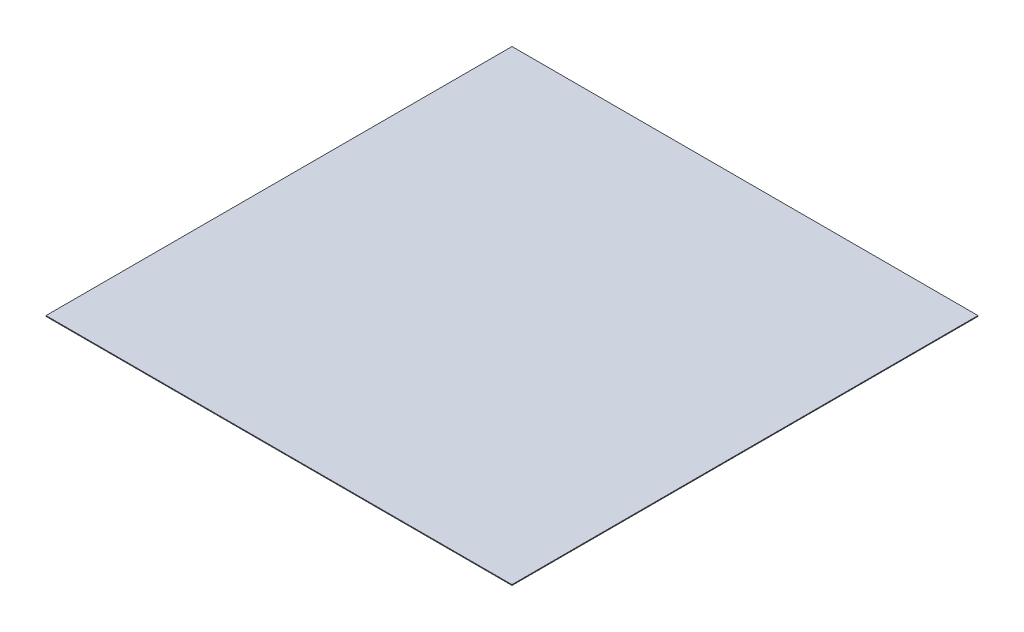
ISO-10303-21;
HEADER;
FILE_DESCRIPTION(('STEP AP214'),'2;1');
FILE_NAME('part.step','',(''),(''),'','','');
FILE_SCHEMA(('AUTOMOTIVE_DESIGN { 1 0 10303 214 1 1 1 1 }'));
ENDSEC;
DATA;
#1=APPLICATION_CONTEXT('core data for automotive mechanical design processes');
#2=APPLICATION_PROTOCOL_DEFINITION('international standard','automotive_design',2000,#1);
#3=PRODUCT_CONTEXT('',#1,'mechanical');
#4=PRODUCT('Part','Part','',(#3));
#5=PRODUCT_RELATED_PRODUCT_CATEGORY('part','',(#4));
#6=PRODUCT_DEFINITION_FORMATION('','',#4);
#7=PRODUCT_DEFINITION_CONTEXT('part definition',#1,'design');
#8=PRODUCT_DEFINITION('design','',#6,#7);
#9=PRODUCT_DEFINITION_SHAPE('','',#8);
#10=(LENGTH_UNIT() NAMED_UNIT(*) SI_UNIT(.MILLI.,.METRE.));
#11=(NAMED_UNIT(*) PLANE_ANGLE_UNIT() SI_UNIT($,.RADIAN.));
#12=(NAMED_UNIT(*) SI_UNIT($,.STERADIAN.) SOLID_ANGLE_UNIT());
#13=UNCERTAINTY_MEASURE_WITH_UNIT(LENGTH_MEASURE(1.E-05),#10,'distance_accuracy_value','');
#14=(GEOMETRIC_REPRESENTATION_CONTEXT(3) GLOBAL_UNCERTAINTY_ASSIGNED_CONTEXT((#13)) GLOBAL_UNIT_ASSIGNED_CONTEXT((#10,
#11,#12)) REPRESENTATION_CONTEXT('',''));
#15=CARTESIAN_POINT('',(0.,0.,0.));
#16=DIRECTION('',(0.,0.,1.));
#17=DIRECTION('',(1.,0.,0.));
#18=AXIS2_PLACEMENT_3D('',#15,#16,#17);
#19=CARTESIAN_POINT('',(640.,-400.,-40.0000000000001));
#20=DIRECTION('',(0.,0.,-1.));
#21=DIRECTION('',(-1.,0.,0.));
#22=AXIS2_PLACEMENT_3D('',#19,#20,#21);
#23=PLANE('',#22);
#24=DIRECTION('',(-1.,0.,0.));
#25=VECTOR('',#24,1.);
#26=CARTESIAN_POINT('',(640.,-300.,-40.0000000000001));
#27=LINE('',#26,#25);
#28=CARTESIAN_POINT('',(640.,-300.,-40.0000000000001));
#29=VERTEX_POINT('',#28);
#30=CARTESIAN_POINT('',(560.,-300.,-40.0000000000001));
#31=VERTEX_POINT('',#30);
#32=EDGE_CURVE('E114',#29,#31,#27,.T.);
#33=ORIENTED_EDGE('',*,*,#32,.F.);
#34=DIRECTION('',(0.,1.,0.));
#35=VECTOR('',#34,1.);
#36=CARTESIAN_POINT('',(640.,-400.,-40.0000000000001));
#37=LINE('',#36,#35);
#38=CARTESIAN_POINT('',(640.,-400.,-40.0000000000001));
#39=VERTEX_POINT('',#38);
#40=EDGE_CURVE('E12',#39,#29,#37,.T.);
#41=ORIENTED_EDGE('',*,*,#40,.F.);
#42=DIRECTION('',(-1.,0.,0.));
#43=VECTOR('',#42,1.);
#44=CARTESIAN_POINT('',(640.,-400.,-40.0000000000001));
#45=LINE('',#44,#43);
#46=CARTESIAN_POINT('',(560.,-400.,-40.0000000000001));
#47=VERTEX_POINT('',#46);
#48=EDGE_CURVE('E109',#39,#47,#45,.T.);
#49=ORIENTED_EDGE('',*,*,#48,.T.);
#50=DIRECTION('',(0.,1.,0.));
#51=VECTOR('',#50,1.);
#52=CARTESIAN_POINT('',(560.,-400.,-40.0000000000001));
#53=LINE('',#52,#51);
#54=EDGE_CURVE('E52',#47,#31,#53,.T.);
#55=ORIENTED_EDGE('',*,*,#54,.T.);
#56=EDGE_LOOP('',(#33,#41,#49,#55));
#57=FACE_BOUND('',#56,.T.);
#58=ADVANCED_FACE('F49',(#57),#23,.T.);
#59=CARTESIAN_POINT('',(640.,-400.,-40.0000000000001));
#60=DIRECTION('',(-1.,0.,0.));
#61=DIRECTION('',(0.,0.,1.));
#62=AXIS2_PLACEMENT_3D('',#59,#60,#61);
#63=PLANE('',#62);
#64=DIRECTION('',(0.,0.,1.));
#65=VECTOR('',#64,1.);
#66=CARTESIAN_POINT('',(640.,-300.,-40.0000000000001));
#67=LINE('',#66,#65);
#68=CARTESIAN_POINT('',(640.,-300.,39.9999999999999));
#69=VERTEX_POINT('',#68);
#70=EDGE_CURVE('E82',#29,#69,#67,.T.);
#71=ORIENTED_EDGE('',*,*,#70,.T.);
#72=DIRECTION('',(0.,1.,0.));
#73=VECTOR('',#72,1.);
#74=CARTESIAN_POINT('',(640.,-400.,39.9999999999999));
#75=LINE('',#74,#73);
#76=CARTESIAN_POINT('',(640.,-400.,39.9999999999999));
#77=VERTEX_POINT('',#76);
#78=EDGE_CURVE('E58',#77,#69,#75,.T.);
#79=ORIENTED_EDGE('',*,*,#78,.F.);
#80=DIRECTION('',(0.,0.,1.));
#81=VECTOR('',#80,1.);
#82=CARTESIAN_POINT('',(640.,-400.,-40.0000000000001));
#83=LINE('',#82,#81);
#84=EDGE_CURVE('E99',#39,#77,#83,.T.);
#85=ORIENTED_EDGE('',*,*,#84,.F.);
#86=ORIENTED_EDGE('',*,*,#40,.T.);
#87=EDGE_LOOP('',(#71,#79,#85,#86));
#88=FACE_BOUND('',#87,.T.);
#89=ADVANCED_FACE('F124',(#88),#63,.F.);
#90=CARTESIAN_POINT('',(640.,-400.,39.9999999999999));
#91=DIRECTION('',(0.,0.,-1.));
#92=DIRECTION('',(-1.,0.,0.));
#93=AXIS2_PLACEMENT_3D('',#90,#91,#92);
#94=PLANE('',#93);
#95=DIRECTION('',(-1.,0.,0.));
#96=VECTOR('',#95,1.);
#97=CARTESIAN_POINT('',(640.,-300.,39.9999999999999));
#98=LINE('',#97,#96);
#99=CARTESIAN_POINT('',(560.,-300.,39.9999999999999));
#100=VERTEX_POINT('',#99);
#101=EDGE_CURVE('E106',#69,#100,#98,.T.);
#102=ORIENTED_EDGE('',*,*,#101,.T.);
#103=DIRECTION('',(0.,1.,0.));
#104=VECTOR('',#103,1.);
#105=CARTESIAN_POINT('',(560.,-400.,39.9999999999999));
#106=LINE('',#105,#104);
#107=CARTESIAN_POINT('',(560.,-400.,39.9999999999999));
#108=VERTEX_POINT('',#107);
#109=EDGE_CURVE('E103',#108,#100,#106,.T.);
#110=ORIENTED_EDGE('',*,*,#109,.F.);
#111=DIRECTION('',(-1.,0.,0.));
#112=VECTOR('',#111,1.);
#113=CARTESIAN_POINT('',(640.,-400.,39.9999999999999));
#114=LINE('',#113,#112);
#115=EDGE_CURVE('E94',#77,#108,#114,.T.);
#116=ORIENTED_EDGE('',*,*,#115,.F.);
#117=ORIENTED_EDGE('',*,*,#78,.T.);
#118=EDGE_LOOP('',(#102,#110,#116,#117));
#119=FACE_BOUND('',#118,.T.);
#120=ADVANCED_FACE('F104',(#119),#94,.F.);
#121=CARTESIAN_POINT('',(560.,-400.,-40.0000000000001));
#122=DIRECTION('',(-1.,0.,0.));
#123=DIRECTION('',(0.,0.,1.));
#124=AXIS2_PLACEMENT_3D('',#121,#122,#123);
#125=PLANE('',#124);
#126=DIRECTION('',(0.,0.,1.));
#127=VECTOR('',#126,1.);
#128=CARTESIAN_POINT('',(560.,-300.,-40.0000000000001));
#129=LINE('',#128,#127);
#130=EDGE_CURVE('E117',#31,#100,#129,.T.);
#131=ORIENTED_EDGE('',*,*,#130,.F.);
#132=ORIENTED_EDGE('',*,*,#54,.F.);
#133=DIRECTION('',(0.,0.,1.));
#134=VECTOR('',#133,1.);
#135=CARTESIAN_POINT('',(560.,-400.,-40.0000000000001));
#136=LINE('',#135,#134);
#137=EDGE_CURVE('E98',#47,#108,#136,.T.);
#138=ORIENTED_EDGE('',*,*,#137,.T.);
#139=ORIENTED_EDGE('',*,*,#109,.T.);
#140=EDGE_LOOP('',(#131,#132,#138,#139));
#141=FACE_BOUND('',#140,.T.);
#142=ADVANCED_FACE('F108',(#141),#125,.T.);
#143=CARTESIAN_POINT('',(0.,-400.,0.));
#144=DIRECTION('',(0.,1.,0.));
#145=DIRECTION('',(0.,0.,1.));
#146=AXIS2_PLACEMENT_3D('',#143,#144,#145);
#147=PLANE('',#146);
#148=ORIENTED_EDGE('',*,*,#48,.F.);
#149=ORIENTED_EDGE('',*,*,#84,.T.);
#150=ORIENTED_EDGE('',*,*,#115,.T.);
#151=ORIENTED_EDGE('',*,*,#137,.F.);
#152=EDGE_LOOP('',(#148,#149,#150,#151));
#153=FACE_BOUND('',#152,.T.);
#154=ADVANCED_FACE('F97',(#153),#147,.F.);
#155=CARTESIAN_POINT('',(0.,-300.,0.));
#156=DIRECTION('',(0.,1.,0.));
#157=DIRECTION('',(0.,0.,1.));
#158=AXIS2_PLACEMENT_3D('',#155,#156,#157);
#159=PLANE('',#158);
#160=ORIENTED_EDGE('',*,*,#32,.T.);
#161=ORIENTED_EDGE('',*,*,#130,.T.);
#162=ORIENTED_EDGE('',*,*,#101,.F.);
#163=ORIENTED_EDGE('',*,*,#70,.F.);
#164=EDGE_LOOP('',(#160,#161,#162,#163));
#165=FACE_BOUND('',#164,.T.);
#166=ADVANCED_FACE('F122',(#165),#159,.T.);
#167=CLOSED_SHELL('',(#58,#89,#120,#142,#154,#166));
#168=MANIFOLD_SOLID_BREP('B2',#167);
#169=CARTESIAN_POINT('',(0.,0.,0.));
#170=DIRECTION('',(0.,1.,0.));
#171=DIRECTION('',(0.,0.,1.));
#172=AXIS2_PLACEMENT_3D('',#169,#170,#171);
#173=PLANE('',#172);
#174=DIRECTION('',(0.,0.,1.));
#175=VECTOR('',#174,1.);
#176=CARTESIAN_POINT('',(200.000000000004,0.,0.));
#177=LINE('',#176,#175);
#178=CARTESIAN_POINT('',(200.000000000004,0.,399.999999999996));
#179=VERTEX_POINT('',#178);
#180=CARTESIAN_POINT('',(200.000000000004,0.,799.999999999996));
#181=VERTEX_POINT('',#180);
#182=EDGE_CURVE('E296',#179,#181,#177,.T.);
#183=ORIENTED_EDGE('',*,*,#182,.F.);
#184=DIRECTION('',(-1.,0.,0.));
#185=VECTOR('',#184,1.);
#186=CARTESIAN_POINT('',(0.,0.,399.999999999996));
#187=LINE('',#186,#185);
#188=CARTESIAN_POINT('',(-199.999999999996,0.,399.999999999996));
#189=VERTEX_POINT('',#188);
#190=EDGE_CURVE('E271',#179,#189,#187,.T.);
#191=ORIENTED_EDGE('',*,*,#190,.T.);
#192=DIRECTION('',(0.,0.,1.));
#193=VECTOR('',#192,1.);
#194=CARTESIAN_POINT('',(-199.999999999996,0.,0.));
#195=LINE('',#194,#193);
#196=CARTESIAN_POINT('',(-199.999999999996,0.,799.999999999996));
#197=VERTEX_POINT('',#196);
#198=EDGE_CURVE('E287',#189,#197,#195,.T.);
#199=ORIENTED_EDGE('',*,*,#198,.T.);
#200=DIRECTION('',(-1.,0.,0.));
#201=VECTOR('',#200,1.);
#202=CARTESIAN_POINT('',(0.,0.,799.999999999996));
#203=LINE('',#202,#201);
#204=EDGE_CURVE('E188',#181,#197,#203,.T.);
#205=ORIENTED_EDGE('',*,*,#204,.F.);
#206=EDGE_LOOP('',(#183,#191,#199,#205));
#207=FACE_BOUND('',#206,.T.);
#208=DIRECTION('',(0.,0.,-1.));
#209=VECTOR('',#208,1.);
#210=CARTESIAN_POINT('',(15000.,0.,-15000.));
#211=LINE('',#210,#209);
#212=CARTESIAN_POINT('',(15000.,0.,15000.));
#213=VERTEX_POINT('',#212);
#214=CARTESIAN_POINT('',(15000.,0.,-15000.));
#215=VERTEX_POINT('',#214);
#216=EDGE_CURVE('E350',#213,#215,#211,.T.);
#217=ORIENTED_EDGE('',*,*,#216,.F.);
#218=DIRECTION('',(1.,0.,0.));
#219=VECTOR('',#218,1.);
#220=CARTESIAN_POINT('',(-15000.,0.,15000.));
#221=LINE('',#220,#219);
#222=CARTESIAN_POINT('',(-15000.,0.,15000.));
#223=VERTEX_POINT('',#222);
#224=EDGE_CURVE('E355',#223,#213,#221,.T.);
#225=ORIENTED_EDGE('',*,*,#224,.F.);
#226=DIRECTION('',(0.,0.,1.));
#227=VECTOR('',#226,1.);
#228=CARTESIAN_POINT('',(-15000.,0.,-15000.));
#229=LINE('',#228,#227);
#230=CARTESIAN_POINT('',(-15000.,0.,-15000.));
#231=VERTEX_POINT('',#230);
#232=EDGE_CURVE('E366',#231,#223,#229,.T.);
#233=ORIENTED_EDGE('',*,*,#232,.F.);
#234=DIRECTION('',(-1.,0.,0.));
#235=VECTOR('',#234,1.);
#236=CARTESIAN_POINT('',(-15000.,0.,-15000.));
#237=LINE('',#236,#235);
#238=EDGE_CURVE('E364',#215,#231,#237,.T.);
#239=ORIENTED_EDGE('',*,*,#238,.F.);
#240=EDGE_LOOP('',(#217,#225,#233,#239));
#241=FACE_BOUND('',#240,.T.);
#242=CARTESIAN_POINT('',(0.,0.,215.9));
#243=DIRECTION('',(0.,1.,0.));
#244=DIRECTION('',(0.,0.,1.));
#245=AXIS2_PLACEMENT_3D('',#242,#243,#244);
#246=CIRCLE('',#245,25.4000000000014);
#247=CARTESIAN_POINT('',(0.,0.,241.300000000001));
#248=VERTEX_POINT('',#247);
#249=EDGE_CURVE('E380',#248,#248,#246,.F.);
#250=ORIENTED_EDGE('',*,*,#249,.F.);
#251=EDGE_LOOP('',(#250));
#252=FACE_BOUND('',#251,.T.);
#253=CARTESIAN_POINT('',(186.974884677063,0.,107.950000000005));
#254=DIRECTION('',(0.,1.,0.));
#255=DIRECTION('',(0.,0.,1.));
#256=AXIS2_PLACEMENT_3D('',#253,#254,#255);
#257=CIRCLE('',#256,25.4000000000033);
#258=CARTESIAN_POINT('',(186.974884677063,0.,133.350000000009));
#259=VERTEX_POINT('',#258);
#260=EDGE_CURVE('E383',#259,#259,#257,.F.);
#261=ORIENTED_EDGE('',*,*,#260,.F.);
#262=EDGE_LOOP('',(#261));
#263=FACE_BOUND('',#262,.T.);
#264=CARTESIAN_POINT('',(186.974884677069,0.,-107.949999999995));
#265=DIRECTION('',(0.,1.,0.));
#266=DIRECTION('',(0.,0.,1.));
#267=AXIS2_PLACEMENT_3D('',#264,#265,#266);
#268=CIRCLE('',#267,25.4000000000096);
#269=CARTESIAN_POINT('',(186.974884677069,0.,-82.549999999985));
#270=VERTEX_POINT('',#269);
#271=EDGE_CURVE('E386',#270,#270,#268,.F.);
#272=ORIENTED_EDGE('',*,*,#271,.F.);
#273=EDGE_LOOP('',(#272));
#274=FACE_BOUND('',#273,.T.);
#275=CARTESIAN_POINT('',(1.22196138832613E-11,0.,-215.9));
#276=DIRECTION('',(0.,1.,0.));
#277=DIRECTION('',(0.,0.,1.));
#278=AXIS2_PLACEMENT_3D('',#275,#276,#277);
#279=CIRCLE('',#278,25.4000000000146);
#280=CARTESIAN_POINT('',(1.22196138832613E-11,0.,-190.499999999985));
#281=VERTEX_POINT('',#280);
#282=EDGE_CURVE('E389',#281,#281,#279,.F.);
#283=ORIENTED_EDGE('',*,*,#282,.F.);
#284=EDGE_LOOP('',(#283));
#285=FACE_BOUND('',#284,.T.);
#286=CARTESIAN_POINT('',(-186.974884677051,0.,-107.950000000005));
#287=DIRECTION('',(0.,1.,0.));
#288=DIRECTION('',(0.,0.,1.));
#289=AXIS2_PLACEMENT_3D('',#286,#287,#288);
#290=CIRCLE('',#289,25.4000000000137);
#291=CARTESIAN_POINT('',(-186.974884677051,0.,-82.5499999999917));
#292=VERTEX_POINT('',#291);
#293=EDGE_CURVE('E181',#292,#292,#290,.F.);
#294=ORIENTED_EDGE('',*,*,#293,.F.);
#295=EDGE_LOOP('',(#294));
#296=FACE_BOUND('',#295,.T.);
#297=CARTESIAN_POINT('',(-186.974884677057,0.,107.949999999995));
#298=DIRECTION('',(0.,1.,0.));
#299=DIRECTION('',(0.,0.,1.));
#300=AXIS2_PLACEMENT_3D('',#297,#298,#299);
#301=CIRCLE('',#300,25.4000000000085);
#302=CARTESIAN_POINT('',(-186.974884677057,0.,133.350000000003));
#303=VERTEX_POINT('',#302);
#304=EDGE_CURVE('E47',#303,#303,#301,.F.);
#305=ORIENTED_EDGE('',*,*,#304,.F.);
#306=EDGE_LOOP('',(#305));
#307=FACE_BOUND('',#306,.T.);
#308=DIRECTION('',(1.,0.,0.));
#309=VECTOR('',#308,1.);
#310=CARTESIAN_POINT('',(0.,0.,-200.));
#311=LINE('',#310,#309);
#312=CARTESIAN_POINT('',(400.,0.,-200.));
#313=VERTEX_POINT('',#312);
#314=CARTESIAN_POINT('',(800.,0.,-200.));
#315=VERTEX_POINT('',#314);
#316=EDGE_CURVE('E274',#313,#315,#311,.T.);
#317=ORIENTED_EDGE('',*,*,#316,.F.);
#318=DIRECTION('',(0.,0.,-1.));
#319=VECTOR('',#318,1.);
#320=CARTESIAN_POINT('',(400.,0.,0.));
#321=LINE('',#320,#319);
#322=CARTESIAN_POINT('',(400.,0.,200.));
#323=VERTEX_POINT('',#322);
#324=EDGE_CURVE('E306',#323,#313,#321,.T.);
#325=ORIENTED_EDGE('',*,*,#324,.F.);
#326=DIRECTION('',(1.,0.,0.));
#327=VECTOR('',#326,1.);
#328=CARTESIAN_POINT('',(0.,0.,200.));
#329=LINE('',#328,#327);
#330=CARTESIAN_POINT('',(800.,0.,200.));
#331=VERTEX_POINT('',#330);
#332=EDGE_CURVE('E318',#323,#331,#329,.T.);
#333=ORIENTED_EDGE('',*,*,#332,.T.);
#334=DIRECTION('',(0.,0.,-1.));
#335=VECTOR('',#334,1.);
#336=CARTESIAN_POINT('',(800.,0.,0.));
#337=LINE('',#336,#335);
#338=EDGE_CURVE('E196',#331,#315,#337,.T.);
#339=ORIENTED_EDGE('',*,*,#338,.T.);
#340=EDGE_LOOP('',(#317,#325,#333,#339));
#341=FACE_BOUND('',#340,.T.);
#342=ADVANCED_FACE('F173',(#207,#241,#252,#263,#274,#285,#296,#307,#341),#173,.F.);
#343=CARTESIAN_POINT('',(15000.,50.,-15000.));
#344=DIRECTION('',(-1.,0.,0.));
#345=DIRECTION('',(0.,0.,1.));
#346=AXIS2_PLACEMENT_3D('',#343,#344,#345);
#347=PLANE('',#346);
#348=ORIENTED_EDGE('',*,*,#216,.T.);
#349=DIRECTION('',(0.,-1.,0.));
#350=VECTOR('',#349,1.);
#351=CARTESIAN_POINT('',(15000.,50.,-15000.));
#352=LINE('',#351,#350);
#353=CARTESIAN_POINT('',(15000.,50.,-15000.));
#354=VERTEX_POINT('',#353);
#355=EDGE_CURVE('E377',#354,#215,#352,.T.);
#356=ORIENTED_EDGE('',*,*,#355,.F.);
#357=DIRECTION('',(0.,0.,-1.));
#358=VECTOR('',#357,1.);
#359=CARTESIAN_POINT('',(15000.,50.,-15000.));
#360=LINE('',#359,#358);
#361=CARTESIAN_POINT('',(15000.,50.,15000.));
#362=VERTEX_POINT('',#361);
#363=EDGE_CURVE('E351',#362,#354,#360,.T.);
#364=ORIENTED_EDGE('',*,*,#363,.F.);
#365=DIRECTION('',(0.,-1.,0.));
#366=VECTOR('',#365,1.);
#367=CARTESIAN_POINT('',(15000.,50.,15000.));
#368=LINE('',#367,#366);
#369=EDGE_CURVE('E361',#362,#213,#368,.T.);
#370=ORIENTED_EDGE('',*,*,#369,.T.);
#371=EDGE_LOOP('',(#348,#356,#364,#370));
#372=FACE_BOUND('',#371,.T.);
#373=ADVANCED_FACE('F175',(#372),#347,.F.);
#374=CARTESIAN_POINT('',(-15000.,50.,-15000.));
#375=DIRECTION('',(0.,0.,1.));
#376=DIRECTION('',(1.,0.,0.));
#377=AXIS2_PLACEMENT_3D('',#374,#375,#376);
#378=PLANE('',#377);
#379=ORIENTED_EDGE('',*,*,#238,.T.);
#380=DIRECTION('',(0.,-1.,0.));
#381=VECTOR('',#380,1.);
#382=CARTESIAN_POINT('',(-15000.,50.,-15000.));
#383=LINE('',#382,#381);
#384=CARTESIAN_POINT('',(-15000.,50.,-15000.));
#385=VERTEX_POINT('',#384);
#386=EDGE_CURVE('E374',#385,#231,#383,.T.);
#387=ORIENTED_EDGE('',*,*,#386,.F.);
#388=DIRECTION('',(-1.,0.,0.));
#389=VECTOR('',#388,1.);
#390=CARTESIAN_POINT('',(-15000.,50.,-15000.));
#391=LINE('',#390,#389);
#392=EDGE_CURVE('E354',#354,#385,#391,.T.);
#393=ORIENTED_EDGE('',*,*,#392,.F.);
#394=ORIENTED_EDGE('',*,*,#355,.T.);
#395=EDGE_LOOP('',(#379,#387,#393,#394));
#396=FACE_BOUND('',#395,.T.);
#397=ADVANCED_FACE('F485',(#396),#378,.F.);
#398=CARTESIAN_POINT('',(-15000.,50.,-15000.));
#399=DIRECTION('',(1.,0.,0.));
#400=DIRECTION('',(0.,0.,-1.));
#401=AXIS2_PLACEMENT_3D('',#398,#399,#400);
#402=PLANE('',#401);
#403=ORIENTED_EDGE('',*,*,#232,.T.);
#404=DIRECTION('',(0.,-1.,0.));
#405=VECTOR('',#404,1.);
#406=CARTESIAN_POINT('',(-15000.,50.,15000.));
#407=LINE('',#406,#405);
#408=CARTESIAN_POINT('',(-15000.,50.,15000.));
#409=VERTEX_POINT('',#408);
#410=EDGE_CURVE('E371',#409,#223,#407,.T.);
#411=ORIENTED_EDGE('',*,*,#410,.F.);
#412=DIRECTION('',(0.,0.,1.));
#413=VECTOR('',#412,1.);
#414=CARTESIAN_POINT('',(-15000.,50.,-15000.));
#415=LINE('',#414,#413);
#416=EDGE_CURVE('E357',#385,#409,#415,.T.);
#417=ORIENTED_EDGE('',*,*,#416,.F.);
#418=ORIENTED_EDGE('',*,*,#386,.T.);
#419=EDGE_LOOP('',(#403,#411,#417,#418));
#420=FACE_BOUND('',#419,.T.);
#421=ADVANCED_FACE('F482',(#420),#402,.F.);
#422=CARTESIAN_POINT('',(-15000.,50.,15000.));
#423=DIRECTION('',(0.,0.,-1.));
#424=DIRECTION('',(-1.,0.,0.));
#425=AXIS2_PLACEMENT_3D('',#422,#423,#424);
#426=PLANE('',#425);
#427=ORIENTED_EDGE('',*,*,#224,.T.);
#428=ORIENTED_EDGE('',*,*,#369,.F.);
#429=DIRECTION('',(1.,0.,0.));
#430=VECTOR('',#429,1.);
#431=CARTESIAN_POINT('',(-15000.,50.,15000.));
#432=LINE('',#431,#430);
#433=EDGE_CURVE('E359',#409,#362,#432,.T.);
#434=ORIENTED_EDGE('',*,*,#433,.F.);
#435=ORIENTED_EDGE('',*,*,#410,.T.);
#436=EDGE_LOOP('',(#427,#428,#434,#435));
#437=FACE_BOUND('',#436,.T.);
#438=ADVANCED_FACE('F477',(#437),#426,.F.);
#439=CARTESIAN_POINT('',(0.,50.,0.));
#440=DIRECTION('',(0.,1.,0.));
#441=DIRECTION('',(0.,0.,1.));
#442=AXIS2_PLACEMENT_3D('',#439,#440,#441);
#443=PLANE('',#442);
#444=ORIENTED_EDGE('',*,*,#363,.T.);
#445=ORIENTED_EDGE('',*,*,#392,.T.);
#446=ORIENTED_EDGE('',*,*,#416,.T.);
#447=ORIENTED_EDGE('',*,*,#433,.T.);
#448=EDGE_LOOP('',(#444,#445,#446,#447));
#449=FACE_BOUND('',#448,.T.);
#450=ADVANCED_FACE('F474',(#449),#443,.T.);
#451=CARTESIAN_POINT('',(0.,-100.,215.9));
#452=DIRECTION('',(0.,1.,0.));
#453=DIRECTION('',(0.,0.,1.));
#454=AXIS2_PLACEMENT_3D('',#451,#452,#453);
#455=CYLINDRICAL_SURFACE('',#454,25.4000000000014);
#456=CARTESIAN_POINT('',(0.,-100.,215.9));
#457=DIRECTION('',(0.,-1.,0.));
#458=DIRECTION('',(0.,0.,-1.));
#459=AXIS2_PLACEMENT_3D('',#456,#457,#458);
#460=CIRCLE('',#459,25.4000000000014);
#461=CARTESIAN_POINT('',(0.,-100.,190.499999999999));
#462=VERTEX_POINT('',#461);
#463=EDGE_CURVE('E347',#462,#462,#460,.T.);
#464=ORIENTED_EDGE('',*,*,#463,.F.);
#465=EDGE_LOOP('',(#464));
#466=FACE_BOUND('',#465,.T.);
#467=ORIENTED_EDGE('',*,*,#249,.T.);
#468=EDGE_LOOP('',(#467));
#469=FACE_BOUND('',#468,.T.);
#470=ADVANCED_FACE('F470',(#466,#469),#455,.T.);
#471=CARTESIAN_POINT('',(0.,-100.,215.9));
#472=DIRECTION('',(0.,-1.,0.));
#473=DIRECTION('',(0.,0.,-1.));
#474=AXIS2_PLACEMENT_3D('',#471,#472,#473);
#475=PLANE('',#474);
#476=ORIENTED_EDGE('',*,*,#463,.T.);
#477=EDGE_LOOP('',(#476));
#478=FACE_BOUND('',#477,.T.);
#479=ADVANCED_FACE('F466',(#478),#475,.T.);
#480=CARTESIAN_POINT('',(186.974884677063,-100.,107.950000000005));
#481=DIRECTION('',(0.,1.,0.));
#482=DIRECTION('',(0.,0.,1.));
#483=AXIS2_PLACEMENT_3D('',#480,#481,#482);
#484=CYLINDRICAL_SURFACE('',#483,25.4000000000033);
#485=CARTESIAN_POINT('',(186.974884677063,-100.,107.950000000005));
#486=DIRECTION('',(0.,-1.,0.));
#487=DIRECTION('',(0.,0.,-1.));
#488=AXIS2_PLACEMENT_3D('',#485,#486,#487);
#489=CIRCLE('',#488,25.4000000000033);
#490=CARTESIAN_POINT('',(186.974884677063,-100.,82.550000000002));
#491=VERTEX_POINT('',#490);
#492=EDGE_CURVE('E344',#491,#491,#489,.T.);
#493=ORIENTED_EDGE('',*,*,#492,.F.);
#494=EDGE_LOOP('',(#493));
#495=FACE_BOUND('',#494,.T.);
#496=ORIENTED_EDGE('',*,*,#260,.T.);
#497=EDGE_LOOP('',(#496));
#498=FACE_BOUND('',#497,.T.);
#499=ADVANCED_FACE('F462',(#495,#498),#484,.T.);
#500=CARTESIAN_POINT('',(186.974884677063,-100.,107.950000000005));
#501=DIRECTION('',(0.,-1.,0.));
#502=DIRECTION('',(0.,0.,-1.));
#503=AXIS2_PLACEMENT_3D('',#500,#501,#502);
#504=PLANE('',#503);
#505=ORIENTED_EDGE('',*,*,#492,.T.);
#506=EDGE_LOOP('',(#505));
#507=FACE_BOUND('',#506,.T.);
#508=ADVANCED_FACE('F458',(#507),#504,.T.);
#509=CARTESIAN_POINT('',(186.974884677069,-100.,-107.949999999995));
#510=DIRECTION('',(0.,1.,0.));
#511=DIRECTION('',(0.,0.,1.));
#512=AXIS2_PLACEMENT_3D('',#509,#510,#511);
#513=CYLINDRICAL_SURFACE('',#512,25.4000000000096);
#514=CARTESIAN_POINT('',(186.974884677069,-100.,-107.949999999995));
#515=DIRECTION('',(0.,-1.,0.));
#516=DIRECTION('',(0.,0.,-1.));
#517=AXIS2_PLACEMENT_3D('',#514,#515,#516);
#518=CIRCLE('',#517,25.4000000000096);
#519=CARTESIAN_POINT('',(186.974884677069,-100.,-133.350000000004));
#520=VERTEX_POINT('',#519);
#521=EDGE_CURVE('E341',#520,#520,#518,.T.);
#522=ORIENTED_EDGE('',*,*,#521,.F.);
#523=EDGE_LOOP('',(#522));
#524=FACE_BOUND('',#523,.T.);
#525=ORIENTED_EDGE('',*,*,#271,.T.);
#526=EDGE_LOOP('',(#525));
#527=FACE_BOUND('',#526,.T.);
#528=ADVANCED_FACE('F454',(#524,#527),#513,.T.);
#529=CARTESIAN_POINT('',(186.974884677069,-100.,-107.949999999995));
#530=DIRECTION('',(0.,-1.,0.));
#531=DIRECTION('',(0.,0.,-1.));
#532=AXIS2_PLACEMENT_3D('',#529,#530,#531);
#533=PLANE('',#532);
#534=ORIENTED_EDGE('',*,*,#521,.T.);
#535=EDGE_LOOP('',(#534));
#536=FACE_BOUND('',#535,.T.);
#537=ADVANCED_FACE('F450',(#536),#533,.T.);
#538=CARTESIAN_POINT('',(1.22196138832613E-11,-100.,-215.9));
#539=DIRECTION('',(0.,1.,0.));
#540=DIRECTION('',(0.,0.,1.));
#541=AXIS2_PLACEMENT_3D('',#538,#539,#540);
#542=CYLINDRICAL_SURFACE('',#541,25.4000000000146);
#543=CARTESIAN_POINT('',(1.22196138832613E-11,-100.,-215.9));
#544=DIRECTION('',(0.,-1.,0.));
#545=DIRECTION('',(0.,0.,-1.));
#546=AXIS2_PLACEMENT_3D('',#543,#544,#545);
#547=CIRCLE('',#546,25.4000000000146);
#548=CARTESIAN_POINT('',(1.22196138832613E-11,-100.,-241.300000000015));
#549=VERTEX_POINT('',#548);
#550=EDGE_CURVE('E338',#549,#549,#547,.T.);
#551=ORIENTED_EDGE('',*,*,#550,.F.);
#552=EDGE_LOOP('',(#551));
#553=FACE_BOUND('',#552,.T.);
#554=ORIENTED_EDGE('',*,*,#282,.T.);
#555=EDGE_LOOP('',(#554));
#556=FACE_BOUND('',#555,.T.);
#557=ADVANCED_FACE('F446',(#553,#556),#542,.T.);
#558=CARTESIAN_POINT('',(1.22196138832613E-11,-100.,-215.9));
#559=DIRECTION('',(0.,-1.,0.));
#560=DIRECTION('',(0.,0.,-1.));
#561=AXIS2_PLACEMENT_3D('',#558,#559,#560);
#562=PLANE('',#561);
#563=ORIENTED_EDGE('',*,*,#550,.T.);
#564=EDGE_LOOP('',(#563));
#565=FACE_BOUND('',#564,.T.);
#566=ADVANCED_FACE('F442',(#565),#562,.T.);
#567=CARTESIAN_POINT('',(-186.974884677051,-100.,-107.950000000005));
#568=DIRECTION('',(0.,1.,0.));
#569=DIRECTION('',(0.,0.,1.));
#570=AXIS2_PLACEMENT_3D('',#567,#568,#569);
#571=CYLINDRICAL_SURFACE('',#570,25.4000000000137);
#572=CARTESIAN_POINT('',(-186.974884677051,-100.,-107.950000000005));
#573=DIRECTION('',(0.,-1.,0.));
#574=DIRECTION('',(0.,0.,-1.));
#575=AXIS2_PLACEMENT_3D('',#572,#573,#574);
#576=CIRCLE('',#575,25.4000000000137);
#577=CARTESIAN_POINT('',(-186.974884677051,-100.,-133.350000000019));
#578=VERTEX_POINT('',#577);
#579=EDGE_CURVE('E335',#578,#578,#576,.T.);
#580=ORIENTED_EDGE('',*,*,#579,.F.);
#581=EDGE_LOOP('',(#580));
#582=FACE_BOUND('',#581,.T.);
#583=ORIENTED_EDGE('',*,*,#293,.T.);
#584=EDGE_LOOP('',(#583));
#585=FACE_BOUND('',#584,.T.);
#586=ADVANCED_FACE('F394',(#582,#585),#571,.T.);
#587=CARTESIAN_POINT('',(-186.974884677051,-100.,-107.950000000005));
#588=DIRECTION('',(0.,-1.,0.));
#589=DIRECTION('',(0.,0.,-1.));
#590=AXIS2_PLACEMENT_3D('',#587,#588,#589);
#591=PLANE('',#590);
#592=ORIENTED_EDGE('',*,*,#579,.T.);
#593=EDGE_LOOP('',(#592));
#594=FACE_BOUND('',#593,.T.);
#595=ADVANCED_FACE('F435',(#594),#591,.T.);
#596=CARTESIAN_POINT('',(-186.974884677057,-100.,107.949999999995));
#597=DIRECTION('',(0.,1.,0.));
#598=DIRECTION('',(0.,0.,1.));
#599=AXIS2_PLACEMENT_3D('',#596,#597,#598);
#600=CYLINDRICAL_SURFACE('',#599,25.4000000000085);
#601=CARTESIAN_POINT('',(-186.974884677057,-100.,107.949999999995));
#602=DIRECTION('',(0.,-1.,0.));
#603=DIRECTION('',(0.,0.,-1.));
#604=AXIS2_PLACEMENT_3D('',#601,#602,#603);
#605=CIRCLE('',#604,25.4000000000085);
#606=CARTESIAN_POINT('',(-186.974884677057,-100.,82.5499999999861));
#607=VERTEX_POINT('',#606);
#608=EDGE_CURVE('E332',#607,#607,#605,.T.);
#609=ORIENTED_EDGE('',*,*,#608,.F.);
#610=EDGE_LOOP('',(#609));
#611=FACE_BOUND('',#610,.T.);
#612=ORIENTED_EDGE('',*,*,#304,.T.);
#613=EDGE_LOOP('',(#612));
#614=FACE_BOUND('',#613,.T.);
#615=ADVANCED_FACE('F431',(#611,#614),#600,.T.);
#616=CARTESIAN_POINT('',(-186.974884677057,-100.,107.949999999995));
#617=DIRECTION('',(0.,-1.,0.));
#618=DIRECTION('',(0.,0.,-1.));
#619=AXIS2_PLACEMENT_3D('',#616,#617,#618);
#620=PLANE('',#619);
#621=ORIENTED_EDGE('',*,*,#608,.T.);
#622=EDGE_LOOP('',(#621));
#623=FACE_BOUND('',#622,.T.);
#624=ADVANCED_FACE('F425',(#623),#620,.T.);
#625=CARTESIAN_POINT('',(0.,-300.,-200.));
#626=DIRECTION('',(0.,0.,1.));
#627=DIRECTION('',(1.,0.,0.));
#628=AXIS2_PLACEMENT_3D('',#625,#626,#627);
#629=PLANE('',#628);
#630=ORIENTED_EDGE('',*,*,#316,.T.);
#631=DIRECTION('',(0.,1.,0.));
#632=VECTOR('',#631,1.);
#633=CARTESIAN_POINT('',(800.,-300.,-200.));
#634=LINE('',#633,#632);
#635=CARTESIAN_POINT('',(800.,-300.,-200.));
#636=VERTEX_POINT('',#635);
#637=EDGE_CURVE('E330',#636,#315,#634,.T.);
#638=ORIENTED_EDGE('',*,*,#637,.F.);
#639=DIRECTION('',(1.,0.,0.));
#640=VECTOR('',#639,1.);
#641=CARTESIAN_POINT('',(0.,-300.,-200.));
#642=LINE('',#641,#640);
#643=CARTESIAN_POINT('',(400.,-300.,-200.));
#644=VERTEX_POINT('',#643);
#645=EDGE_CURVE('E303',#644,#636,#642,.T.);
#646=ORIENTED_EDGE('',*,*,#645,.F.);
#647=DIRECTION('',(0.,1.,0.));
#648=VECTOR('',#647,1.);
#649=CARTESIAN_POINT('',(400.,-300.,-200.));
#650=LINE('',#649,#648);
#651=EDGE_CURVE('E314',#644,#313,#650,.T.);
#652=ORIENTED_EDGE('',*,*,#651,.T.);
#653=EDGE_LOOP('',(#630,#638,#646,#652));
#654=FACE_BOUND('',#653,.T.);
#655=ADVANCED_FACE('F409',(#654),#629,.F.);
#656=CARTESIAN_POINT('',(800.,-300.,0.));
#657=DIRECTION('',(1.,0.,0.));
#658=DIRECTION('',(0.,0.,-1.));
#659=AXIS2_PLACEMENT_3D('',#656,#657,#658);
#660=PLANE('',#659);
#661=ORIENTED_EDGE('',*,*,#338,.F.);
#662=DIRECTION('',(0.,1.,0.));
#663=VECTOR('',#662,1.);
#664=CARTESIAN_POINT('',(800.,-300.,200.));
#665=LINE('',#664,#663);
#666=CARTESIAN_POINT('',(800.,-300.,200.));
#667=VERTEX_POINT('',#666);
#668=EDGE_CURVE('E327',#667,#331,#665,.T.);
#669=ORIENTED_EDGE('',*,*,#668,.F.);
#670=DIRECTION('',(0.,0.,-1.));
#671=VECTOR('',#670,1.);
#672=CARTESIAN_POINT('',(800.,-300.,0.));
#673=LINE('',#672,#671);
#674=EDGE_CURVE('E305',#667,#636,#673,.T.);
#675=ORIENTED_EDGE('',*,*,#674,.T.);
#676=ORIENTED_EDGE('',*,*,#637,.T.);
#677=EDGE_LOOP('',(#661,#669,#675,#676));
#678=FACE_BOUND('',#677,.T.);
#679=ADVANCED_FACE('F417',(#678),#660,.T.);
#680=CARTESIAN_POINT('',(0.,-300.,200.));
#681=DIRECTION('',(0.,0.,1.));
#682=DIRECTION('',(1.,0.,0.));
#683=AXIS2_PLACEMENT_3D('',#680,#681,#682);
#684=PLANE('',#683);
#685=ORIENTED_EDGE('',*,*,#332,.F.);
#686=DIRECTION('',(0.,1.,0.));
#687=VECTOR('',#686,1.);
#688=CARTESIAN_POINT('',(400.,-300.,200.));
#689=LINE('',#688,#687);
#690=CARTESIAN_POINT('',(400.,-300.,200.));
#691=VERTEX_POINT('',#690);
#692=EDGE_CURVE('E324',#691,#323,#689,.T.);
#693=ORIENTED_EDGE('',*,*,#692,.F.);
#694=DIRECTION('',(1.,0.,0.));
#695=VECTOR('',#694,1.);
#696=CARTESIAN_POINT('',(0.,-300.,200.));
#697=LINE('',#696,#695);
#698=EDGE_CURVE('E309',#691,#667,#697,.T.);
#699=ORIENTED_EDGE('',*,*,#698,.T.);
#700=ORIENTED_EDGE('',*,*,#668,.T.);
#701=EDGE_LOOP('',(#685,#693,#699,#700));
#702=FACE_BOUND('',#701,.T.);
#703=ADVANCED_FACE('F415',(#702),#684,.T.);
#704=CARTESIAN_POINT('',(400.,-300.,0.));
#705=DIRECTION('',(1.,0.,0.));
#706=DIRECTION('',(0.,0.,-1.));
#707=AXIS2_PLACEMENT_3D('',#704,#705,#706);
#708=PLANE('',#707);
#709=ORIENTED_EDGE('',*,*,#324,.T.);
#710=ORIENTED_EDGE('',*,*,#651,.F.);
#711=DIRECTION('',(0.,0.,-1.));
#712=VECTOR('',#711,1.);
#713=CARTESIAN_POINT('',(400.,-300.,0.));
#714=LINE('',#713,#712);
#715=EDGE_CURVE('E312',#691,#644,#714,.T.);
#716=ORIENTED_EDGE('',*,*,#715,.F.);
#717=ORIENTED_EDGE('',*,*,#692,.T.);
#718=EDGE_LOOP('',(#709,#710,#716,#717));
#719=FACE_BOUND('',#718,.T.);
#720=ADVANCED_FACE('F405',(#719),#708,.F.);
#721=CARTESIAN_POINT('',(0.,-300.,0.));
#722=DIRECTION('',(0.,-1.,0.));
#723=DIRECTION('',(0.,0.,-1.));
#724=AXIS2_PLACEMENT_3D('',#721,#722,#723);
#725=PLANE('',#724);
#726=ORIENTED_EDGE('',*,*,#645,.T.);
#727=ORIENTED_EDGE('',*,*,#674,.F.);
#728=ORIENTED_EDGE('',*,*,#698,.F.);
#729=ORIENTED_EDGE('',*,*,#715,.T.);
#730=EDGE_LOOP('',(#726,#727,#728,#729));
#731=FACE_BOUND('',#730,.T.);
#732=ADVANCED_FACE('F412',(#731),#725,.T.);
#733=CARTESIAN_POINT('',(0.,-300.,399.999999999996));
#734=DIRECTION('',(0.,0.,-1.));
#735=DIRECTION('',(-1.,0.,0.));
#736=AXIS2_PLACEMENT_3D('',#733,#734,#735);
#737=PLANE('',#736);
#738=ORIENTED_EDGE('',*,*,#190,.F.);
#739=DIRECTION('',(0.,1.,0.));
#740=VECTOR('',#739,1.);
#741=CARTESIAN_POINT('',(200.000000000004,-300.,399.999999999996));
#742=LINE('',#741,#740);
#743=CARTESIAN_POINT('',(200.000000000004,-300.,399.999999999996));
#744=VERTEX_POINT('',#743);
#745=EDGE_CURVE('E264',#744,#179,#742,.T.);
#746=ORIENTED_EDGE('',*,*,#745,.F.);
#747=DIRECTION('',(-1.,0.,0.));
#748=VECTOR('',#747,1.);
#749=CARTESIAN_POINT('',(0.,-300.,399.999999999996));
#750=LINE('',#749,#748);
#751=CARTESIAN_POINT('',(-199.999999999996,-300.,399.999999999996));
#752=VERTEX_POINT('',#751);
#753=EDGE_CURVE('E268',#744,#752,#750,.T.);
#754=ORIENTED_EDGE('',*,*,#753,.T.);
#755=DIRECTION('',(0.,1.,0.));
#756=VECTOR('',#755,1.);
#757=CARTESIAN_POINT('',(-199.999999999996,-300.,399.999999999996));
#758=LINE('',#757,#756);
#759=EDGE_CURVE('E294',#752,#189,#758,.T.);
#760=ORIENTED_EDGE('',*,*,#759,.T.);
#761=EDGE_LOOP('',(#738,#746,#754,#760));
#762=FACE_BOUND('',#761,.T.);
#763=ADVANCED_FACE('F266',(#762),#737,.T.);
#764=CARTESIAN_POINT('',(200.000000000004,-300.,0.));
#765=DIRECTION('',(-1.,0.,0.));
#766=DIRECTION('',(0.,0.,1.));
#767=AXIS2_PLACEMENT_3D('',#764,#765,#766);
#768=PLANE('',#767);
#769=ORIENTED_EDGE('',*,*,#182,.T.);
#770=DIRECTION('',(0.,1.,0.));
#771=VECTOR('',#770,1.);
#772=CARTESIAN_POINT('',(200.000000000004,-300.,799.999999999996));
#773=LINE('',#772,#771);
#774=CARTESIAN_POINT('',(200.000000000004,-300.,799.999999999996));
#775=VERTEX_POINT('',#774);
#776=EDGE_CURVE('E275',#775,#181,#773,.T.);
#777=ORIENTED_EDGE('',*,*,#776,.F.);
#778=DIRECTION('',(0.,0.,1.));
#779=VECTOR('',#778,1.);
#780=CARTESIAN_POINT('',(200.000000000004,-300.,0.));
#781=LINE('',#780,#779);
#782=EDGE_CURVE('E278',#744,#775,#781,.T.);
#783=ORIENTED_EDGE('',*,*,#782,.F.);
#784=ORIENTED_EDGE('',*,*,#745,.T.);
#785=EDGE_LOOP('',(#769,#777,#783,#784));
#786=FACE_BOUND('',#785,.T.);
#787=ADVANCED_FACE('F279',(#786),#768,.F.);
#788=CARTESIAN_POINT('',(0.,-300.,799.999999999996));
#789=DIRECTION('',(0.,0.,-1.));
#790=DIRECTION('',(-1.,0.,0.));
#791=AXIS2_PLACEMENT_3D('',#788,#789,#790);
#792=PLANE('',#791);
#793=ORIENTED_EDGE('',*,*,#204,.T.);
#794=DIRECTION('',(0.,1.,0.));
#795=VECTOR('',#794,1.);
#796=CARTESIAN_POINT('',(-199.999999999996,-300.,799.999999999996));
#797=LINE('',#796,#795);
#798=CARTESIAN_POINT('',(-199.999999999996,-300.,799.999999999996));
#799=VERTEX_POINT('',#798);
#800=EDGE_CURVE('E300',#799,#197,#797,.T.);
#801=ORIENTED_EDGE('',*,*,#800,.F.);
#802=DIRECTION('',(-1.,0.,0.));
#803=VECTOR('',#802,1.);
#804=CARTESIAN_POINT('',(0.,-300.,799.999999999996));
#805=LINE('',#804,#803);
#806=EDGE_CURVE('E282',#775,#799,#805,.T.);
#807=ORIENTED_EDGE('',*,*,#806,.F.);
#808=ORIENTED_EDGE('',*,*,#776,.T.);
#809=EDGE_LOOP('',(#793,#801,#807,#808));
#810=FACE_BOUND('',#809,.T.);
#811=ADVANCED_FACE('F666',(#810),#792,.F.);
#812=CARTESIAN_POINT('',(-199.999999999996,-300.,0.));
#813=DIRECTION('',(-1.,0.,0.));
#814=DIRECTION('',(0.,0.,1.));
#815=AXIS2_PLACEMENT_3D('',#812,#813,#814);
#816=PLANE('',#815);
#817=ORIENTED_EDGE('',*,*,#198,.F.);
#818=ORIENTED_EDGE('',*,*,#759,.F.);
#819=DIRECTION('',(0.,0.,1.));
#820=VECTOR('',#819,1.);
#821=CARTESIAN_POINT('',(-199.999999999996,-300.,0.));
#822=LINE('',#821,#820);
#823=EDGE_CURVE('E286',#752,#799,#822,.T.);
#824=ORIENTED_EDGE('',*,*,#823,.T.);
#825=ORIENTED_EDGE('',*,*,#800,.T.);
#826=EDGE_LOOP('',(#817,#818,#824,#825));
#827=FACE_BOUND('',#826,.T.);
#828=ADVANCED_FACE('F675',(#827),#816,.T.);
#829=CARTESIAN_POINT('',(0.,-300.,0.));
#830=DIRECTION('',(0.,-1.,0.));
#831=DIRECTION('',(0.,0.,-1.));
#832=AXIS2_PLACEMENT_3D('',#829,#830,#831);
#833=PLANE('',#832);
#834=ORIENTED_EDGE('',*,*,#753,.F.);
#835=ORIENTED_EDGE('',*,*,#782,.T.);
#836=ORIENTED_EDGE('',*,*,#806,.T.);
#837=ORIENTED_EDGE('',*,*,#823,.F.);
#838=EDGE_LOOP('',(#834,#835,#836,#837));
#839=FACE_BOUND('',#838,.T.);
#840=ADVANCED_FACE('F284',(#839),#833,.T.);
#841=CLOSED_SHELL('',(#342,#373,#397,#421,#438,#450,#470,#479,#499,#508,#528,#537,#557,#566,
#586,#595,#615,#624,#655,#679,#703,#720,#732,#763,#787,#811,#828,#840));
#842=MANIFOLD_SOLID_BREP('B6',#841);
#843=ADVANCED_BREP_SHAPE_REPRESENTATION('',(#18,#168,#842),#14);
#844=SHAPE_DEFINITION_REPRESENTATION(#9,#843);
ENDSEC;
END-ISO-10303-21;
